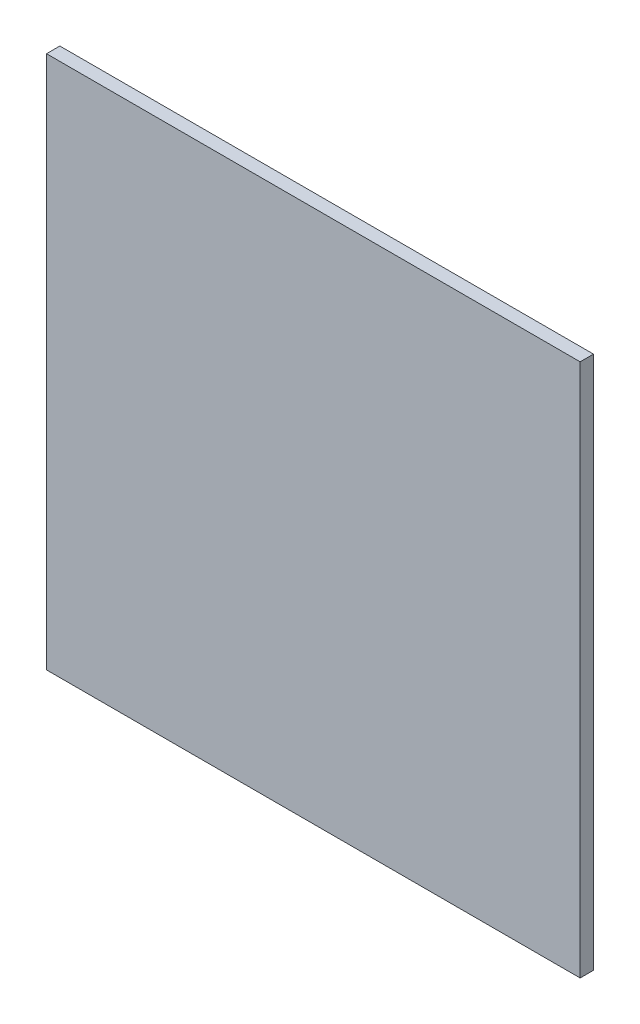
ISO-10303-21;
HEADER;
FILE_DESCRIPTION(('STEP AP214'),'2;1');
FILE_NAME('part.step','',(''),(''),'','','');
FILE_SCHEMA(('AUTOMOTIVE_DESIGN { 1 0 10303 214 1 1 1 1 }'));
ENDSEC;
DATA;
#1=APPLICATION_CONTEXT('core data for automotive mechanical design processes');
#2=APPLICATION_PROTOCOL_DEFINITION('international standard','automotive_design',2000,#1);
#3=PRODUCT_CONTEXT('',#1,'mechanical');
#4=PRODUCT('Part','Part','',(#3));
#5=PRODUCT_RELATED_PRODUCT_CATEGORY('part','',(#4));
#6=PRODUCT_DEFINITION_FORMATION('','',#4);
#7=PRODUCT_DEFINITION_CONTEXT('part definition',#1,'design');
#8=PRODUCT_DEFINITION('design','',#6,#7);
#9=PRODUCT_DEFINITION_SHAPE('','',#8);
#10=(LENGTH_UNIT() NAMED_UNIT(*) SI_UNIT(.MILLI.,.METRE.));
#11=(NAMED_UNIT(*) PLANE_ANGLE_UNIT() SI_UNIT($,.RADIAN.));
#12=(NAMED_UNIT(*) SI_UNIT($,.STERADIAN.) SOLID_ANGLE_UNIT());
#13=UNCERTAINTY_MEASURE_WITH_UNIT(LENGTH_MEASURE(1.E-05),#10,'distance_accuracy_value','');
#14=(GEOMETRIC_REPRESENTATION_CONTEXT(3) GLOBAL_UNCERTAINTY_ASSIGNED_CONTEXT((#13)) GLOBAL_UNIT_ASSIGNED_CONTEXT((#10,
#11,#12)) REPRESENTATION_CONTEXT('',''));
#15=CARTESIAN_POINT('',(0.,0.,0.));
#16=DIRECTION('',(0.,0.,1.));
#17=DIRECTION('',(1.,0.,0.));
#18=AXIS2_PLACEMENT_3D('',#15,#16,#17);
#19=CARTESIAN_POINT('',(-9.066,-3.8,-6.999));
#20=DIRECTION('',(0.,1.,0.));
#21=DIRECTION('',(1.,0.,0.));
#22=AXIS2_PLACEMENT_3D('',#19,#20,#21);
#23=PLANE('',#22);
#24=DIRECTION('',(0.,0.,1.));
#25=VECTOR('',#24,1.);
#26=CARTESIAN_POINT('',(-8.265,-3.8,-7.01));
#27=LINE('',#26,#25);
#28=CARTESIAN_POINT('',(-8.265,-3.8,-7.02));
#29=VERTEX_POINT('',#28);
#30=CARTESIAN_POINT('',(-8.265,-3.8,-7.));
#31=VERTEX_POINT('',#30);
#32=EDGE_CURVE('E21',#29,#31,#27,.T.);
#33=ORIENTED_EDGE('',*,*,#32,.F.);
#34=DIRECTION('',(1.,0.,0.));
#35=VECTOR('',#34,1.);
#36=CARTESIAN_POINT('',(-8.665,-3.8,-7.02));
#37=LINE('',#36,#35);
#38=CARTESIAN_POINT('',(-9.065,-3.8,-7.02));
#39=VERTEX_POINT('',#38);
#40=EDGE_CURVE('E81',#39,#29,#37,.T.);
#41=ORIENTED_EDGE('',*,*,#40,.F.);
#42=DIRECTION('',(0.,0.,-1.));
#43=VECTOR('',#42,1.);
#44=CARTESIAN_POINT('',(-9.065,-3.8,-7.01));
#45=LINE('',#44,#43);
#46=CARTESIAN_POINT('',(-9.065,-3.8,-7.));
#47=VERTEX_POINT('',#46);
#48=EDGE_CURVE('E69',#47,#39,#45,.T.);
#49=ORIENTED_EDGE('',*,*,#48,.F.);
#50=DIRECTION('',(-1.,0.,0.));
#51=VECTOR('',#50,1.);
#52=CARTESIAN_POINT('',(-8.665,-3.8,-7.));
#53=LINE('',#52,#51);
#54=EDGE_CURVE('E56',#31,#47,#53,.T.);
#55=ORIENTED_EDGE('',*,*,#54,.F.);
#56=EDGE_LOOP('',(#33,#41,#49,#55));
#57=FACE_BOUND('',#56,.T.);
#58=ADVANCED_FACE('F17',(#57),#23,.T.);
#59=CARTESIAN_POINT('',(-8.265,-3.799,-6.999));
#60=DIRECTION('',(1.,0.,0.));
#61=DIRECTION('',(0.,-1.,0.));
#62=AXIS2_PLACEMENT_3D('',#59,#60,#61);
#63=PLANE('',#62);
#64=DIRECTION('',(0.,0.,1.));
#65=VECTOR('',#64,1.);
#66=CARTESIAN_POINT('',(-8.265,-4.6,-7.01));
#67=LINE('',#66,#65);
#68=CARTESIAN_POINT('',(-8.265,-4.6,-7.02));
#69=VERTEX_POINT('',#68);
#70=CARTESIAN_POINT('',(-8.265,-4.6,-7.));
#71=VERTEX_POINT('',#70);
#72=EDGE_CURVE('E84',#69,#71,#67,.T.);
#73=ORIENTED_EDGE('',*,*,#72,.F.);
#74=DIRECTION('',(0.,-1.,0.));
#75=VECTOR('',#74,1.);
#76=CARTESIAN_POINT('',(-8.265,-4.2,-7.02));
#77=LINE('',#76,#75);
#78=EDGE_CURVE('E65',#29,#69,#77,.T.);
#79=ORIENTED_EDGE('',*,*,#78,.F.);
#80=ORIENTED_EDGE('',*,*,#32,.T.);
#81=DIRECTION('',(0.,1.,0.));
#82=VECTOR('',#81,1.);
#83=CARTESIAN_POINT('',(-8.265,-4.2,-7.));
#84=LINE('',#83,#82);
#85=EDGE_CURVE('E62',#71,#31,#84,.T.);
#86=ORIENTED_EDGE('',*,*,#85,.F.);
#87=EDGE_LOOP('',(#73,#79,#80,#86));
#88=FACE_BOUND('',#87,.T.);
#89=ADVANCED_FACE('F61',(#88),#63,.T.);
#90=CARTESIAN_POINT('',(-8.264,-3.799,-7.));
#91=DIRECTION('',(0.,0.,1.));
#92=DIRECTION('',(-1.,0.,0.));
#93=AXIS2_PLACEMENT_3D('',#90,#91,#92);
#94=PLANE('',#93);
#95=DIRECTION('',(0.,1.,0.));
#96=VECTOR('',#95,1.);
#97=CARTESIAN_POINT('',(-9.065,-4.2,-7.));
#98=LINE('',#97,#96);
#99=CARTESIAN_POINT('',(-9.065,-4.6,-7.));
#100=VERTEX_POINT('',#99);
#101=EDGE_CURVE('E71',#100,#47,#98,.T.);
#102=ORIENTED_EDGE('',*,*,#101,.F.);
#103=DIRECTION('',(-1.,0.,0.));
#104=VECTOR('',#103,1.);
#105=CARTESIAN_POINT('',(-8.665,-4.6,-7.));
#106=LINE('',#105,#104);
#107=EDGE_CURVE('E75',#71,#100,#106,.T.);
#108=ORIENTED_EDGE('',*,*,#107,.F.);
#109=ORIENTED_EDGE('',*,*,#85,.T.);
#110=ORIENTED_EDGE('',*,*,#54,.T.);
#111=EDGE_LOOP('',(#102,#108,#109,#110));
#112=FACE_BOUND('',#111,.T.);
#113=ADVANCED_FACE('F73',(#112),#94,.T.);
#114=CARTESIAN_POINT('',(-9.065,-4.601,-6.999));
#115=DIRECTION('',(-1.,0.,0.));
#116=DIRECTION('',(0.,1.,0.));
#117=AXIS2_PLACEMENT_3D('',#114,#115,#116);
#118=PLANE('',#117);
#119=ORIENTED_EDGE('',*,*,#48,.T.);
#120=DIRECTION('',(0.,1.,0.));
#121=VECTOR('',#120,1.);
#122=CARTESIAN_POINT('',(-9.065,-4.2,-7.02));
#123=LINE('',#122,#121);
#124=CARTESIAN_POINT('',(-9.065,-4.6,-7.02));
#125=VERTEX_POINT('',#124);
#126=EDGE_CURVE('E36',#125,#39,#123,.T.);
#127=ORIENTED_EDGE('',*,*,#126,.F.);
#128=DIRECTION('',(0.,0.,-1.));
#129=VECTOR('',#128,1.);
#130=CARTESIAN_POINT('',(-9.065,-4.6,-7.01));
#131=LINE('',#130,#129);
#132=EDGE_CURVE('E27',#100,#125,#131,.T.);
#133=ORIENTED_EDGE('',*,*,#132,.F.);
#134=ORIENTED_EDGE('',*,*,#101,.T.);
#135=EDGE_LOOP('',(#119,#127,#133,#134));
#136=FACE_BOUND('',#135,.T.);
#137=ADVANCED_FACE('F89',(#136),#118,.T.);
#138=CARTESIAN_POINT('',(-9.066,-3.799,-7.02));
#139=DIRECTION('',(0.,0.,-1.));
#140=DIRECTION('',(1.,0.,0.));
#141=AXIS2_PLACEMENT_3D('',#138,#139,#140);
#142=PLANE('',#141);
#143=ORIENTED_EDGE('',*,*,#40,.T.);
#144=ORIENTED_EDGE('',*,*,#78,.T.);
#145=DIRECTION('',(1.,0.,0.));
#146=VECTOR('',#145,1.);
#147=CARTESIAN_POINT('',(-8.665,-4.6,-7.02));
#148=LINE('',#147,#146);
#149=EDGE_CURVE('E11',#125,#69,#148,.T.);
#150=ORIENTED_EDGE('',*,*,#149,.F.);
#151=ORIENTED_EDGE('',*,*,#126,.T.);
#152=EDGE_LOOP('',(#143,#144,#150,#151));
#153=FACE_BOUND('',#152,.T.);
#154=ADVANCED_FACE('F91',(#153),#142,.T.);
#155=CARTESIAN_POINT('',(-8.264,-4.6,-6.999));
#156=DIRECTION('',(0.,-1.,0.));
#157=DIRECTION('',(-1.,0.,0.));
#158=AXIS2_PLACEMENT_3D('',#155,#156,#157);
#159=PLANE('',#158);
#160=ORIENTED_EDGE('',*,*,#132,.T.);
#161=ORIENTED_EDGE('',*,*,#149,.T.);
#162=ORIENTED_EDGE('',*,*,#72,.T.);
#163=ORIENTED_EDGE('',*,*,#107,.T.);
#164=EDGE_LOOP('',(#160,#161,#162,#163));
#165=FACE_BOUND('',#164,.T.);
#166=ADVANCED_FACE('F19',(#165),#159,.T.);
#167=CLOSED_SHELL('',(#58,#89,#113,#137,#154,#166));
#168=MANIFOLD_SOLID_BREP('B1',#167);
#169=ADVANCED_BREP_SHAPE_REPRESENTATION('',(#18,#168),#14);
#170=SHAPE_DEFINITION_REPRESENTATION(#9,#169);
ENDSEC;
END-ISO-10303-21;
